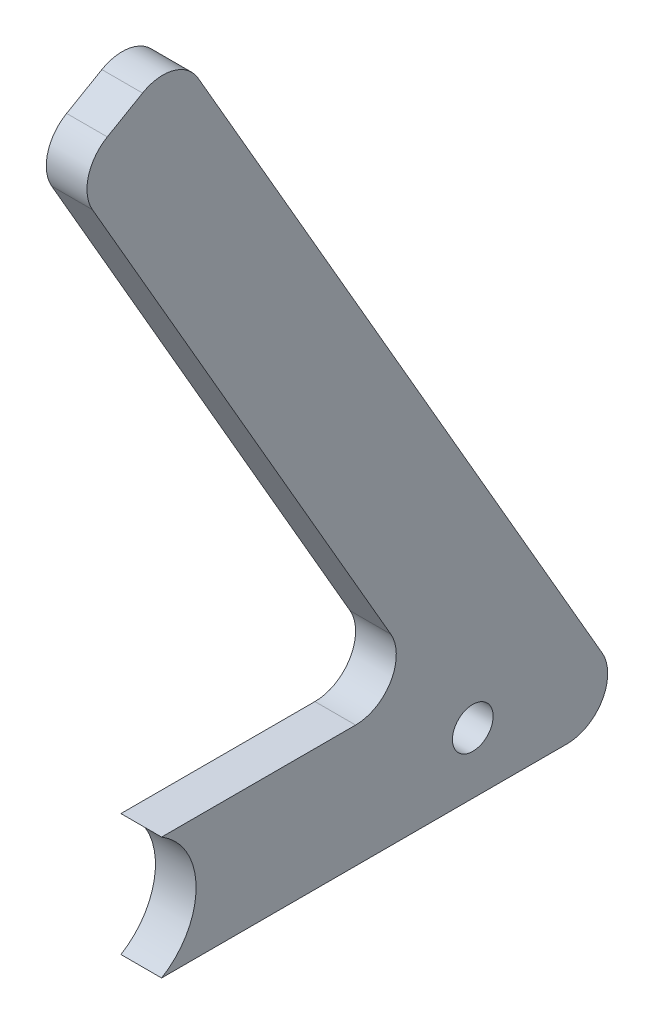
ISO-10303-21;
HEADER;
FILE_DESCRIPTION(('STEP AP214'),'2;1');
FILE_NAME('part.step','',(''),(''),'','','');
FILE_SCHEMA(('AUTOMOTIVE_DESIGN { 1 0 10303 214 1 1 1 1 }'));
ENDSEC;
DATA;
#1=APPLICATION_CONTEXT('core data for automotive mechanical design processes');
#2=APPLICATION_PROTOCOL_DEFINITION('international standard','automotive_design',2000,#1);
#3=PRODUCT_CONTEXT('',#1,'mechanical');
#4=PRODUCT('Part','Part','',(#3));
#5=PRODUCT_RELATED_PRODUCT_CATEGORY('part','',(#4));
#6=PRODUCT_DEFINITION_FORMATION('','',#4);
#7=PRODUCT_DEFINITION_CONTEXT('part definition',#1,'design');
#8=PRODUCT_DEFINITION('design','',#6,#7);
#9=PRODUCT_DEFINITION_SHAPE('','',#8);
#10=(LENGTH_UNIT() NAMED_UNIT(*) SI_UNIT(.MILLI.,.METRE.));
#11=(NAMED_UNIT(*) PLANE_ANGLE_UNIT() SI_UNIT($,.RADIAN.));
#12=(NAMED_UNIT(*) SI_UNIT($,.STERADIAN.) SOLID_ANGLE_UNIT());
#13=UNCERTAINTY_MEASURE_WITH_UNIT(LENGTH_MEASURE(1.E-05),#10,'distance_accuracy_value','');
#14=(GEOMETRIC_REPRESENTATION_CONTEXT(3) GLOBAL_UNCERTAINTY_ASSIGNED_CONTEXT((#13)) GLOBAL_UNIT_ASSIGNED_CONTEXT((#10,
#11,#12)) REPRESENTATION_CONTEXT('',''));
#15=CARTESIAN_POINT('',(0.,0.,0.));
#16=DIRECTION('',(0.,0.,1.));
#17=DIRECTION('',(1.,0.,0.));
#18=AXIS2_PLACEMENT_3D('',#15,#16,#17);
#19=CARTESIAN_POINT('',(-580.,-15.,-100.));
#20=DIRECTION('',(0.,1.,0.));
#21=DIRECTION('',(0.,0.,1.));
#22=AXIS2_PLACEMENT_3D('',#19,#20,#21);
#23=PLANE('',#22);
#24=DIRECTION('',(0.,0.,1.));
#25=VECTOR('',#24,1.);
#26=CARTESIAN_POINT('',(-580.,-15.,-100.));
#27=LINE('',#26,#25);
#28=CARTESIAN_POINT('',(-580.,-15.,-108.660254037844));
#29=VERTEX_POINT('',#28);
#30=CARTESIAN_POINT('',(-580.,-15.,-9.01387818865994));
#31=VERTEX_POINT('',#30);
#32=EDGE_CURVE('E172',#29,#31,#27,.T.);
#33=ORIENTED_EDGE('',*,*,#32,.F.);
#34=DIRECTION('',(1.,0.,0.));
#35=VECTOR('',#34,1.);
#36=CARTESIAN_POINT('',(-580.,-15.,-108.660254037844));
#37=LINE('',#36,#35);
#38=CARTESIAN_POINT('',(-570.,-15.,-108.660254037844));
#39=VERTEX_POINT('',#38);
#40=EDGE_CURVE('E213',#29,#39,#37,.T.);
#41=ORIENTED_EDGE('',*,*,#40,.T.);
#42=DIRECTION('',(0.,0.,1.));
#43=VECTOR('',#42,1.);
#44=CARTESIAN_POINT('',(-570.,-15.,-100.));
#45=LINE('',#44,#43);
#46=CARTESIAN_POINT('',(-570.,-15.,-9.01387818865994));
#47=VERTEX_POINT('',#46);
#48=EDGE_CURVE('E282',#39,#47,#45,.T.);
#49=ORIENTED_EDGE('',*,*,#48,.T.);
#50=DIRECTION('',(-1.,0.,0.));
#51=VECTOR('',#50,1.);
#52=CARTESIAN_POINT('',(617.5,-15.,-9.01387818865994));
#53=LINE('',#52,#51);
#54=EDGE_CURVE('E140',#31,#47,#53,.F.);
#55=ORIENTED_EDGE('',*,*,#54,.F.);
#56=EDGE_LOOP('',(#33,#41,#49,#55));
#57=FACE_BOUND('',#56,.T.);
#58=ADVANCED_FACE('F40',(#57),#23,.F.);
#59=CARTESIAN_POINT('',(-570.,15.,-100.));
#60=DIRECTION('',(0.,-1.,0.));
#61=DIRECTION('',(0.,0.,-1.));
#62=AXIS2_PLACEMENT_3D('',#59,#60,#61);
#63=PLANE('',#62);
#64=DIRECTION('',(0.,0.,1.));
#65=VECTOR('',#64,1.);
#66=CARTESIAN_POINT('',(-570.,15.,-100.));
#67=LINE('',#66,#65);
#68=CARTESIAN_POINT('',(-570.,15.,-56.6987298107778));
#69=VERTEX_POINT('',#68);
#70=CARTESIAN_POINT('',(-570.,15.,-9.01387818865994));
#71=VERTEX_POINT('',#70);
#72=EDGE_CURVE('E118',#69,#71,#67,.T.);
#73=ORIENTED_EDGE('',*,*,#72,.F.);
#74=DIRECTION('',(-1.,0.,0.));
#75=VECTOR('',#74,1.);
#76=CARTESIAN_POINT('',(-580.,15.,-56.6987298107778));
#77=LINE('',#76,#75);
#78=CARTESIAN_POINT('',(-580.,15.,-56.6987298107778));
#79=VERTEX_POINT('',#78);
#80=EDGE_CURVE('E217',#69,#79,#77,.T.);
#81=ORIENTED_EDGE('',*,*,#80,.T.);
#82=DIRECTION('',(0.,0.,1.));
#83=VECTOR('',#82,1.);
#84=CARTESIAN_POINT('',(-580.,15.,-100.));
#85=LINE('',#84,#83);
#86=CARTESIAN_POINT('',(-580.,15.,-9.01387818865994));
#87=VERTEX_POINT('',#86);
#88=EDGE_CURVE('E145',#79,#87,#85,.T.);
#89=ORIENTED_EDGE('',*,*,#88,.T.);
#90=DIRECTION('',(-1.,0.,0.));
#91=VECTOR('',#90,1.);
#92=CARTESIAN_POINT('',(617.5,15.,-9.01387818865994));
#93=LINE('',#92,#91);
#94=EDGE_CURVE('E137',#71,#87,#93,.T.);
#95=ORIENTED_EDGE('',*,*,#94,.F.);
#96=EDGE_LOOP('',(#73,#81,#89,#95));
#97=FACE_BOUND('',#96,.T.);
#98=ADVANCED_FACE('F143',(#97),#63,.F.);
#99=CARTESIAN_POINT('',(-570.,-15.,-100.));
#100=DIRECTION('',(-1.,0.,0.));
#101=DIRECTION('',(0.,0.,1.));
#102=AXIS2_PLACEMENT_3D('',#99,#100,#101);
#103=PLANE('',#102);
#104=CARTESIAN_POINT('',(-570.,0.,-85.5));
#105=DIRECTION('',(1.,0.,0.));
#106=DIRECTION('',(0.,0.,-1.));
#107=AXIS2_PLACEMENT_3D('',#104,#105,#106);
#108=CIRCLE('',#107,4.99999999999999);
#109=CARTESIAN_POINT('',(-570.,0.,-90.5));
#110=VERTEX_POINT('',#109);
#111=EDGE_CURVE('E290',#110,#110,#108,.T.);
#112=ORIENTED_EDGE('',*,*,#111,.F.);
#113=EDGE_LOOP('',(#112));
#114=FACE_BOUND('',#113,.T.);
#115=DIRECTION('',(0.,0.500000000000004,-0.866025403784436));
#116=VECTOR('',#115,1.);
#117=CARTESIAN_POINT('',(-570.,180.705080756887,-12.9903810567657));
#118=LINE('',#117,#116);
#119=CARTESIAN_POINT('',(-570.,170.705080756887,4.33012701892303));
#120=VERTEX_POINT('',#119);
#121=CARTESIAN_POINT('',(-570.,175.705080756887,-4.33012701892136));
#122=VERTEX_POINT('',#121);
#123=EDGE_CURVE('E157',#120,#122,#118,.T.);
#124=ORIENTED_EDGE('',*,*,#123,.F.);
#125=CARTESIAN_POINT('',(-570.,162.044826719043,-0.669872981077029));
#126=DIRECTION('',(-1.,0.,0.));
#127=DIRECTION('',(0.,0.,1.));
#128=AXIS2_PLACEMENT_3D('',#125,#126,#127);
#129=CIRCLE('',#128,10.);
#130=CARTESIAN_POINT('',(-570.,157.044826719043,7.99038105676733));
#131=VERTEX_POINT('',#130);
#132=EDGE_CURVE('E190',#120,#131,#129,.F.);
#133=ORIENTED_EDGE('',*,*,#132,.T.);
#134=DIRECTION('',(0.,-0.866025403784436,-0.500000000000004));
#135=VECTOR('',#134,1.);
#136=CARTESIAN_POINT('',(-570.,165.705080756887,12.9903810567674));
#137=LINE('',#136,#135);
#138=CARTESIAN_POINT('',(-570.,30.0000000000001,-65.3589838486222));
#139=VERTEX_POINT('',#138);
#140=EDGE_CURVE('E130',#131,#139,#137,.T.);
#141=ORIENTED_EDGE('',*,*,#140,.T.);
#142=CARTESIAN_POINT('',(-570.,25.,-56.6987298107778));
#143=DIRECTION('',(-1.,0.,0.));
#144=DIRECTION('',(0.,0.,1.));
#145=AXIS2_PLACEMENT_3D('',#142,#143,#144);
#146=CIRCLE('',#145,10.);
#147=EDGE_CURVE('E11',#139,#69,#146,.T.);
#148=ORIENTED_EDGE('',*,*,#147,.T.);
#149=ORIENTED_EDGE('',*,*,#72,.T.);
#150=CARTESIAN_POINT('',(-570.,0.,0.));
#151=DIRECTION('',(-1.,0.,0.));
#152=DIRECTION('',(0.,0.,1.));
#153=AXIS2_PLACEMENT_3D('',#150,#151,#152);
#154=CIRCLE('',#153,17.5);
#155=EDGE_CURVE('E123',#47,#71,#154,.F.);
#156=ORIENTED_EDGE('',*,*,#155,.F.);
#157=ORIENTED_EDGE('',*,*,#48,.F.);
#158=CARTESIAN_POINT('',(-570.,-5.,-108.660254037844));
#159=DIRECTION('',(-1.,0.,0.));
#160=DIRECTION('',(0.,0.,1.));
#161=AXIS2_PLACEMENT_3D('',#158,#159,#160);
#162=CIRCLE('',#161,10.);
#163=CARTESIAN_POINT('',(-570.,0.,-117.320508075689));
#164=VERTEX_POINT('',#163);
#165=EDGE_CURVE('E184',#39,#164,#162,.F.);
#166=ORIENTED_EDGE('',*,*,#165,.T.);
#167=DIRECTION('',(0.,-0.866025403784436,-0.500000000000004));
#168=VECTOR('',#167,1.);
#169=CARTESIAN_POINT('',(-570.,180.705080756887,-12.9903810567657));
#170=LINE('',#169,#168);
#171=CARTESIAN_POINT('',(-570.,172.044826719043,-17.9903810567658));
#172=VERTEX_POINT('',#171);
#173=EDGE_CURVE('E168',#172,#164,#170,.T.);
#174=ORIENTED_EDGE('',*,*,#173,.F.);
#175=CARTESIAN_POINT('',(-570.,167.044826719043,-9.3301270189214));
#176=DIRECTION('',(-1.,0.,0.));
#177=DIRECTION('',(0.,0.,1.));
#178=AXIS2_PLACEMENT_3D('',#175,#176,#177);
#179=CIRCLE('',#178,10.);
#180=EDGE_CURVE('E187',#172,#122,#179,.F.);
#181=ORIENTED_EDGE('',*,*,#180,.T.);
#182=EDGE_LOOP('',(#124,#133,#141,#148,#149,#156,#157,#166,#174,#181));
#183=FACE_BOUND('',#182,.T.);
#184=ADVANCED_FACE('F121',(#114,#183),#103,.F.);
#185=CARTESIAN_POINT('',(-580.,-15.,-100.));
#186=DIRECTION('',(1.,0.,0.));
#187=DIRECTION('',(0.,0.,-1.));
#188=AXIS2_PLACEMENT_3D('',#185,#186,#187);
#189=PLANE('',#188);
#190=CARTESIAN_POINT('',(-580.,0.,-85.5));
#191=DIRECTION('',(1.,0.,0.));
#192=DIRECTION('',(0.,0.,-1.));
#193=AXIS2_PLACEMENT_3D('',#190,#191,#192);
#194=CIRCLE('',#193,4.99999999999999);
#195=CARTESIAN_POINT('',(-580.,0.,-90.5));
#196=VERTEX_POINT('',#195);
#197=EDGE_CURVE('E283',#196,#196,#194,.T.);
#198=ORIENTED_EDGE('',*,*,#197,.T.);
#199=EDGE_LOOP('',(#198));
#200=FACE_BOUND('',#199,.T.);
#201=DIRECTION('',(0.,-0.866025403784436,-0.500000000000004));
#202=VECTOR('',#201,1.);
#203=CARTESIAN_POINT('',(-580.,165.705080756887,12.9903810567674));
#204=LINE('',#203,#202);
#205=CARTESIAN_POINT('',(-580.,157.044826719043,7.99038105676733));
#206=VERTEX_POINT('',#205);
#207=CARTESIAN_POINT('',(-580.,30.0000000000001,-65.3589838486222));
#208=VERTEX_POINT('',#207);
#209=EDGE_CURVE('E156',#206,#208,#204,.T.);
#210=ORIENTED_EDGE('',*,*,#209,.F.);
#211=CARTESIAN_POINT('',(-580.,162.044826719043,-0.669872981077029));
#212=DIRECTION('',(1.,0.,0.));
#213=DIRECTION('',(0.,0.,-1.));
#214=AXIS2_PLACEMENT_3D('',#211,#212,#213);
#215=CIRCLE('',#214,10.);
#216=CARTESIAN_POINT('',(-580.,170.705080756887,4.33012701892303));
#217=VERTEX_POINT('',#216);
#218=EDGE_CURVE('E204',#206,#217,#215,.F.);
#219=ORIENTED_EDGE('',*,*,#218,.T.);
#220=DIRECTION('',(0.,-0.500000000000004,0.866025403784436));
#221=VECTOR('',#220,1.);
#222=CARTESIAN_POINT('',(-580.,180.705080756887,-12.9903810567657));
#223=LINE('',#222,#221);
#224=CARTESIAN_POINT('',(-580.,175.705080756887,-4.33012701892136));
#225=VERTEX_POINT('',#224);
#226=EDGE_CURVE('E151',#225,#217,#223,.T.);
#227=ORIENTED_EDGE('',*,*,#226,.F.);
#228=CARTESIAN_POINT('',(-580.,167.044826719043,-9.3301270189214));
#229=DIRECTION('',(1.,0.,0.));
#230=DIRECTION('',(0.,0.,-1.));
#231=AXIS2_PLACEMENT_3D('',#228,#229,#230);
#232=CIRCLE('',#231,10.);
#233=CARTESIAN_POINT('',(-580.,172.044826719043,-17.9903810567658));
#234=VERTEX_POINT('',#233);
#235=EDGE_CURVE('E201',#225,#234,#232,.F.);
#236=ORIENTED_EDGE('',*,*,#235,.T.);
#237=DIRECTION('',(0.,-0.866025403784436,-0.500000000000004));
#238=VECTOR('',#237,1.);
#239=CARTESIAN_POINT('',(-580.,180.705080756887,-12.9903810567657));
#240=LINE('',#239,#238);
#241=CARTESIAN_POINT('',(-580.,0.,-117.320508075689));
#242=VERTEX_POINT('',#241);
#243=EDGE_CURVE('E129',#234,#242,#240,.T.);
#244=ORIENTED_EDGE('',*,*,#243,.T.);
#245=CARTESIAN_POINT('',(-580.,-5.,-108.660254037844));
#246=DIRECTION('',(1.,0.,0.));
#247=DIRECTION('',(0.,0.,-1.));
#248=AXIS2_PLACEMENT_3D('',#245,#246,#247);
#249=CIRCLE('',#248,10.);
#250=EDGE_CURVE('E63',#242,#29,#249,.F.);
#251=ORIENTED_EDGE('',*,*,#250,.T.);
#252=ORIENTED_EDGE('',*,*,#32,.T.);
#253=CARTESIAN_POINT('',(-580.,0.,0.));
#254=DIRECTION('',(1.,0.,0.));
#255=DIRECTION('',(0.,0.,-1.));
#256=AXIS2_PLACEMENT_3D('',#253,#254,#255);
#257=CIRCLE('',#256,17.5);
#258=EDGE_CURVE('E147',#87,#31,#257,.F.);
#259=ORIENTED_EDGE('',*,*,#258,.F.);
#260=ORIENTED_EDGE('',*,*,#88,.F.);
#261=CARTESIAN_POINT('',(-580.,25.,-56.6987298107778));
#262=DIRECTION('',(1.,0.,0.));
#263=DIRECTION('',(0.,0.,-1.));
#264=AXIS2_PLACEMENT_3D('',#261,#262,#263);
#265=CIRCLE('',#264,10.);
#266=EDGE_CURVE('E49',#79,#208,#265,.T.);
#267=ORIENTED_EDGE('',*,*,#266,.T.);
#268=EDGE_LOOP('',(#210,#219,#227,#236,#244,#251,#252,#259,#260,#267));
#269=FACE_BOUND('',#268,.T.);
#270=ADVANCED_FACE('F223',(#200,#269),#189,.F.);
#271=CARTESIAN_POINT('',(-580.,180.705080756887,-12.9903810567657));
#272=DIRECTION('',(0.,-0.500000000000004,0.866025403784436));
#273=DIRECTION('',(0.,-0.866025403784436,-0.500000000000004));
#274=AXIS2_PLACEMENT_3D('',#271,#272,#273);
#275=PLANE('',#274);
#276=ORIENTED_EDGE('',*,*,#243,.F.);
#277=DIRECTION('',(-1.,0.,0.));
#278=VECTOR('',#277,1.);
#279=CARTESIAN_POINT('',(-580.,172.044826719043,-17.9903810567658));
#280=LINE('',#279,#278);
#281=EDGE_CURVE('E210',#234,#172,#280,.F.);
#282=ORIENTED_EDGE('',*,*,#281,.T.);
#283=ORIENTED_EDGE('',*,*,#173,.T.);
#284=DIRECTION('',(1.,0.,0.));
#285=VECTOR('',#284,1.);
#286=CARTESIAN_POINT('',(-580.,0.,-117.320508075689));
#287=LINE('',#286,#285);
#288=EDGE_CURVE('E207',#164,#242,#287,.F.);
#289=ORIENTED_EDGE('',*,*,#288,.T.);
#290=EDGE_LOOP('',(#276,#282,#283,#289));
#291=FACE_BOUND('',#290,.T.);
#292=ADVANCED_FACE('F249',(#291),#275,.F.);
#293=CARTESIAN_POINT('',(-570.,165.705080756887,12.9903810567674));
#294=DIRECTION('',(0.,0.500000000000004,-0.866025403784436));
#295=DIRECTION('',(0.,0.866025403784436,0.500000000000004));
#296=AXIS2_PLACEMENT_3D('',#293,#294,#295);
#297=PLANE('',#296);
#298=ORIENTED_EDGE('',*,*,#140,.F.);
#299=DIRECTION('',(1.,0.,0.));
#300=VECTOR('',#299,1.);
#301=CARTESIAN_POINT('',(-570.,157.044826719043,7.99038105676733));
#302=LINE('',#301,#300);
#303=EDGE_CURVE('E196',#131,#206,#302,.F.);
#304=ORIENTED_EDGE('',*,*,#303,.T.);
#305=ORIENTED_EDGE('',*,*,#209,.T.);
#306=DIRECTION('',(-1.,0.,0.));
#307=VECTOR('',#306,1.);
#308=CARTESIAN_POINT('',(-570.,30.,-65.3589838486222));
#309=LINE('',#308,#307);
#310=EDGE_CURVE('E193',#208,#139,#309,.F.);
#311=ORIENTED_EDGE('',*,*,#310,.T.);
#312=EDGE_LOOP('',(#298,#304,#305,#311));
#313=FACE_BOUND('',#312,.T.);
#314=ADVANCED_FACE('F227',(#313),#297,.F.);
#315=CARTESIAN_POINT('',(617.5,0.,0.));
#316=DIRECTION('',(-1.,0.,0.));
#317=DIRECTION('',(0.,0.,1.));
#318=AXIS2_PLACEMENT_3D('',#315,#316,#317);
#319=CYLINDRICAL_SURFACE('',#318,17.5);
#320=ORIENTED_EDGE('',*,*,#54,.T.);
#321=ORIENTED_EDGE('',*,*,#155,.T.);
#322=ORIENTED_EDGE('',*,*,#94,.T.);
#323=ORIENTED_EDGE('',*,*,#258,.T.);
#324=EDGE_LOOP('',(#320,#321,#322,#323));
#325=FACE_BOUND('',#324,.T.);
#326=ADVANCED_FACE('F135',(#325),#319,.F.);
#327=CARTESIAN_POINT('',(0.,173.205080756887,8.32667268468867E-13));
#328=DIRECTION('',(0.,-0.866025403784436,-0.500000000000004));
#329=DIRECTION('',(1.,0.,0.));
#330=AXIS2_PLACEMENT_3D('',#327,#328,#329);
#331=PLANE('',#330);
#332=ORIENTED_EDGE('',*,*,#226,.T.);
#333=DIRECTION('',(1.,0.,0.));
#334=VECTOR('',#333,1.);
#335=CARTESIAN_POINT('',(0.,170.705080756887,4.33012701892302));
#336=LINE('',#335,#334);
#337=EDGE_CURVE('E180',#217,#120,#336,.T.);
#338=ORIENTED_EDGE('',*,*,#337,.T.);
#339=ORIENTED_EDGE('',*,*,#123,.T.);
#340=DIRECTION('',(-1.,0.,0.));
#341=VECTOR('',#340,1.);
#342=CARTESIAN_POINT('',(0.,175.705080756887,-4.33012701892135));
#343=LINE('',#342,#341);
#344=EDGE_CURVE('E161',#122,#225,#343,.T.);
#345=ORIENTED_EDGE('',*,*,#344,.T.);
#346=EDGE_LOOP('',(#332,#338,#339,#345));
#347=FACE_BOUND('',#346,.T.);
#348=ADVANCED_FACE('F261',(#347),#331,.F.);
#349=CARTESIAN_POINT('',(0.,162.044826719043,-0.669872981077029));
#350=DIRECTION('',(1.,0.,0.));
#351=DIRECTION('',(0.,0.,-1.));
#352=AXIS2_PLACEMENT_3D('',#349,#350,#351);
#353=CYLINDRICAL_SURFACE('',#352,10.);
#354=ORIENTED_EDGE('',*,*,#218,.F.);
#355=ORIENTED_EDGE('',*,*,#303,.F.);
#356=ORIENTED_EDGE('',*,*,#132,.F.);
#357=ORIENTED_EDGE('',*,*,#337,.F.);
#358=EDGE_LOOP('',(#354,#355,#356,#357));
#359=FACE_BOUND('',#358,.T.);
#360=ADVANCED_FACE('F264',(#359),#353,.T.);
#361=CARTESIAN_POINT('',(0.,167.044826719043,-9.3301270189214));
#362=DIRECTION('',(-1.,0.,0.));
#363=DIRECTION('',(0.,0.,1.));
#364=AXIS2_PLACEMENT_3D('',#361,#362,#363);
#365=CYLINDRICAL_SURFACE('',#364,10.);
#366=ORIENTED_EDGE('',*,*,#180,.F.);
#367=ORIENTED_EDGE('',*,*,#281,.F.);
#368=ORIENTED_EDGE('',*,*,#235,.F.);
#369=ORIENTED_EDGE('',*,*,#344,.F.);
#370=EDGE_LOOP('',(#366,#367,#368,#369));
#371=FACE_BOUND('',#370,.T.);
#372=ADVANCED_FACE('F238',(#371),#365,.T.);
#373=CARTESIAN_POINT('',(-580.,-5.,-108.660254037844));
#374=DIRECTION('',(1.,0.,0.));
#375=DIRECTION('',(0.,0.,-1.));
#376=AXIS2_PLACEMENT_3D('',#373,#374,#375);
#377=CYLINDRICAL_SURFACE('',#376,10.);
#378=ORIENTED_EDGE('',*,*,#250,.F.);
#379=ORIENTED_EDGE('',*,*,#288,.F.);
#380=ORIENTED_EDGE('',*,*,#165,.F.);
#381=ORIENTED_EDGE('',*,*,#40,.F.);
#382=EDGE_LOOP('',(#378,#379,#380,#381));
#383=FACE_BOUND('',#382,.T.);
#384=ADVANCED_FACE('F231',(#383),#377,.T.);
#385=CARTESIAN_POINT('',(-570.,25.,-56.6987298107778));
#386=DIRECTION('',(1.,0.,0.));
#387=DIRECTION('',(0.,0.,-1.));
#388=AXIS2_PLACEMENT_3D('',#385,#386,#387);
#389=CYLINDRICAL_SURFACE('',#388,10.);
#390=ORIENTED_EDGE('',*,*,#147,.F.);
#391=ORIENTED_EDGE('',*,*,#310,.F.);
#392=ORIENTED_EDGE('',*,*,#266,.F.);
#393=ORIENTED_EDGE('',*,*,#80,.F.);
#394=EDGE_LOOP('',(#390,#391,#392,#393));
#395=FACE_BOUND('',#394,.T.);
#396=ADVANCED_FACE('F42',(#395),#389,.F.);
#397=CARTESIAN_POINT('',(-570.,0.,-85.5));
#398=DIRECTION('',(1.,0.,0.));
#399=DIRECTION('',(0.,0.,-1.));
#400=AXIS2_PLACEMENT_3D('',#397,#398,#399);
#401=CYLINDRICAL_SURFACE('',#400,4.99999999999999);
#402=ORIENTED_EDGE('',*,*,#111,.T.);
#403=EDGE_LOOP('',(#402));
#404=FACE_BOUND('',#403,.T.);
#405=ORIENTED_EDGE('',*,*,#197,.F.);
#406=EDGE_LOOP('',(#405));
#407=FACE_BOUND('',#406,.T.);
#408=ADVANCED_FACE('F230',(#404,#407),#401,.F.);
#409=CLOSED_SHELL('',(#58,#98,#184,#270,#292,#314,#326,#348,#360,#372,#384,#396,#408));
#410=MANIFOLD_SOLID_BREP('B2',#409);
#411=ADVANCED_BREP_SHAPE_REPRESENTATION('',(#18,#410),#14);
#412=SHAPE_DEFINITION_REPRESENTATION(#9,#411);
ENDSEC;
END-ISO-10303-21;
